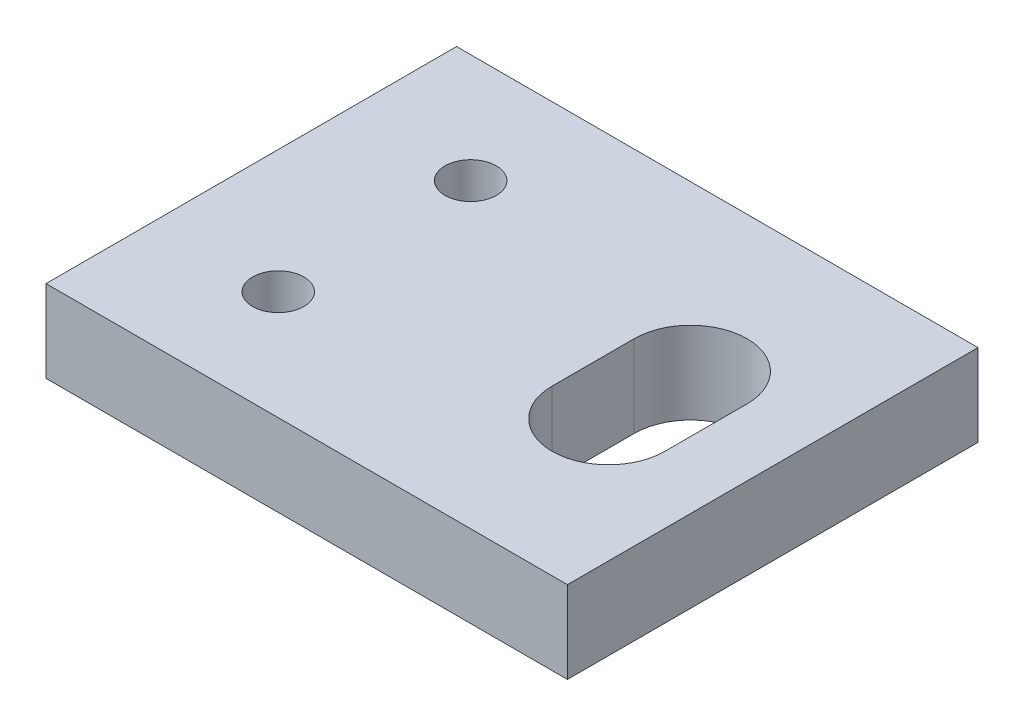
ISO-10303-21;
HEADER;
FILE_DESCRIPTION(('STEP AP214'),'2;1');
FILE_NAME('part.step','',(''),(''),'','','');
FILE_SCHEMA(('AUTOMOTIVE_DESIGN { 1 0 10303 214 1 1 1 1 }'));
ENDSEC;
DATA;
#1=APPLICATION_CONTEXT('core data for automotive mechanical design processes');
#2=APPLICATION_PROTOCOL_DEFINITION('international standard','automotive_design',2000,#1);
#3=PRODUCT_CONTEXT('',#1,'mechanical');
#4=PRODUCT('Part','Part','',(#3));
#5=PRODUCT_RELATED_PRODUCT_CATEGORY('part','',(#4));
#6=PRODUCT_DEFINITION_FORMATION('','',#4);
#7=PRODUCT_DEFINITION_CONTEXT('part definition',#1,'design');
#8=PRODUCT_DEFINITION('design','',#6,#7);
#9=PRODUCT_DEFINITION_SHAPE('','',#8);
#10=(LENGTH_UNIT() NAMED_UNIT(*) SI_UNIT(.MILLI.,.METRE.));
#11=(NAMED_UNIT(*) PLANE_ANGLE_UNIT() SI_UNIT($,.RADIAN.));
#12=(NAMED_UNIT(*) SI_UNIT($,.STERADIAN.) SOLID_ANGLE_UNIT());
#13=UNCERTAINTY_MEASURE_WITH_UNIT(LENGTH_MEASURE(1.E-05),#10,'distance_accuracy_value','');
#14=(GEOMETRIC_REPRESENTATION_CONTEXT(3) GLOBAL_UNCERTAINTY_ASSIGNED_CONTEXT((#13)) GLOBAL_UNIT_ASSIGNED_CONTEXT((#10,
#11,#12)) REPRESENTATION_CONTEXT('',''));
#15=CARTESIAN_POINT('',(0.,0.,0.));
#16=DIRECTION('',(0.,0.,1.));
#17=DIRECTION('',(1.,0.,0.));
#18=AXIS2_PLACEMENT_3D('',#15,#16,#17);
#19=CARTESIAN_POINT('',(0.,0.,0.));
#20=DIRECTION('',(-1.,0.,0.));
#21=DIRECTION('',(0.,0.,1.));
#22=AXIS2_PLACEMENT_3D('',#19,#20,#21);
#23=PLANE('',#22);
#24=DIRECTION('',(0.,0.,1.));
#25=VECTOR('',#24,1.);
#26=CARTESIAN_POINT('',(0.,4.,0.));
#27=LINE('',#26,#25);
#28=CARTESIAN_POINT('',(0.,4.,0.));
#29=VERTEX_POINT('',#28);
#30=CARTESIAN_POINT('',(0.,4.,20.));
#31=VERTEX_POINT('',#30);
#32=EDGE_CURVE('E144',#29,#31,#27,.T.);
#33=ORIENTED_EDGE('',*,*,#32,.F.);
#34=DIRECTION('',(0.,1.,0.));
#35=VECTOR('',#34,1.);
#36=CARTESIAN_POINT('',(0.,0.,0.));
#37=LINE('',#36,#35);
#38=CARTESIAN_POINT('',(0.,0.,0.));
#39=VERTEX_POINT('',#38);
#40=EDGE_CURVE('E11',#39,#29,#37,.T.);
#41=ORIENTED_EDGE('',*,*,#40,.F.);
#42=DIRECTION('',(0.,0.,1.));
#43=VECTOR('',#42,1.);
#44=CARTESIAN_POINT('',(0.,0.,0.));
#45=LINE('',#44,#43);
#46=CARTESIAN_POINT('',(0.,0.,20.));
#47=VERTEX_POINT('',#46);
#48=EDGE_CURVE('E147',#39,#47,#45,.T.);
#49=ORIENTED_EDGE('',*,*,#48,.T.);
#50=DIRECTION('',(0.,1.,0.));
#51=VECTOR('',#50,1.);
#52=CARTESIAN_POINT('',(0.,0.,20.));
#53=LINE('',#52,#51);
#54=EDGE_CURVE('E36',#47,#31,#53,.T.);
#55=ORIENTED_EDGE('',*,*,#54,.T.);
#56=EDGE_LOOP('',(#33,#41,#49,#55));
#57=FACE_BOUND('',#56,.T.);
#58=ADVANCED_FACE('F33',(#57),#23,.T.);
#59=CARTESIAN_POINT('',(25.4,0.,0.));
#60=DIRECTION('',(0.,0.,-1.));
#61=DIRECTION('',(-1.,0.,0.));
#62=AXIS2_PLACEMENT_3D('',#59,#60,#61);
#63=PLANE('',#62);
#64=DIRECTION('',(-1.,0.,0.));
#65=VECTOR('',#64,1.);
#66=CARTESIAN_POINT('',(25.4,4.,0.));
#67=LINE('',#66,#65);
#68=CARTESIAN_POINT('',(25.4,4.,0.));
#69=VERTEX_POINT('',#68);
#70=EDGE_CURVE('E151',#69,#29,#67,.T.);
#71=ORIENTED_EDGE('',*,*,#70,.F.);
#72=DIRECTION('',(0.,1.,0.));
#73=VECTOR('',#72,1.);
#74=CARTESIAN_POINT('',(25.4,0.,0.));
#75=LINE('',#74,#73);
#76=CARTESIAN_POINT('',(25.4,0.,0.));
#77=VERTEX_POINT('',#76);
#78=EDGE_CURVE('E41',#77,#69,#75,.T.);
#79=ORIENTED_EDGE('',*,*,#78,.F.);
#80=DIRECTION('',(-1.,0.,0.));
#81=VECTOR('',#80,1.);
#82=CARTESIAN_POINT('',(25.4,0.,0.));
#83=LINE('',#82,#81);
#84=EDGE_CURVE('E157',#77,#39,#83,.T.);
#85=ORIENTED_EDGE('',*,*,#84,.T.);
#86=ORIENTED_EDGE('',*,*,#40,.T.);
#87=EDGE_LOOP('',(#71,#79,#85,#86));
#88=FACE_BOUND('',#87,.T.);
#89=ADVANCED_FACE('F183',(#88),#63,.T.);
#90=CARTESIAN_POINT('',(25.4,0.,20.));
#91=DIRECTION('',(1.,0.,0.));
#92=DIRECTION('',(0.,0.,-1.));
#93=AXIS2_PLACEMENT_3D('',#90,#91,#92);
#94=PLANE('',#93);
#95=DIRECTION('',(0.,0.,-1.));
#96=VECTOR('',#95,1.);
#97=CARTESIAN_POINT('',(25.4,4.,20.));
#98=LINE('',#97,#96);
#99=CARTESIAN_POINT('',(25.4,4.,20.));
#100=VERTEX_POINT('',#99);
#101=EDGE_CURVE('E165',#100,#69,#98,.T.);
#102=ORIENTED_EDGE('',*,*,#101,.F.);
#103=DIRECTION('',(0.,1.,0.));
#104=VECTOR('',#103,1.);
#105=CARTESIAN_POINT('',(25.4,0.,20.));
#106=LINE('',#105,#104);
#107=CARTESIAN_POINT('',(25.4,0.,20.));
#108=VERTEX_POINT('',#107);
#109=EDGE_CURVE('E170',#108,#100,#106,.T.);
#110=ORIENTED_EDGE('',*,*,#109,.F.);
#111=DIRECTION('',(0.,0.,-1.));
#112=VECTOR('',#111,1.);
#113=CARTESIAN_POINT('',(25.4,0.,20.));
#114=LINE('',#113,#112);
#115=EDGE_CURVE('E154',#108,#77,#114,.T.);
#116=ORIENTED_EDGE('',*,*,#115,.T.);
#117=ORIENTED_EDGE('',*,*,#78,.T.);
#118=EDGE_LOOP('',(#102,#110,#116,#117));
#119=FACE_BOUND('',#118,.T.);
#120=ADVANCED_FACE('F188',(#119),#94,.T.);
#121=CARTESIAN_POINT('',(0.,0.,20.));
#122=DIRECTION('',(0.,0.,1.));
#123=DIRECTION('',(1.,0.,0.));
#124=AXIS2_PLACEMENT_3D('',#121,#122,#123);
#125=PLANE('',#124);
#126=DIRECTION('',(1.,0.,0.));
#127=VECTOR('',#126,1.);
#128=CARTESIAN_POINT('',(0.,4.,20.));
#129=LINE('',#128,#127);
#130=EDGE_CURVE('E162',#31,#100,#129,.T.);
#131=ORIENTED_EDGE('',*,*,#130,.F.);
#132=ORIENTED_EDGE('',*,*,#54,.F.);
#133=DIRECTION('',(1.,0.,0.));
#134=VECTOR('',#133,1.);
#135=CARTESIAN_POINT('',(0.,0.,20.));
#136=LINE('',#135,#134);
#137=EDGE_CURVE('E150',#47,#108,#136,.T.);
#138=ORIENTED_EDGE('',*,*,#137,.T.);
#139=ORIENTED_EDGE('',*,*,#109,.T.);
#140=EDGE_LOOP('',(#131,#132,#138,#139));
#141=FACE_BOUND('',#140,.T.);
#142=ADVANCED_FACE('F178',(#141),#125,.T.);
#143=CARTESIAN_POINT('',(0.,0.,0.));
#144=DIRECTION('',(0.,1.,0.));
#145=DIRECTION('',(0.,0.,1.));
#146=AXIS2_PLACEMENT_3D('',#143,#144,#145);
#147=PLANE('',#146);
#148=DIRECTION('',(0.,0.,1.));
#149=VECTOR('',#148,1.);
#150=CARTESIAN_POINT('',(16.65,0.,12.));
#151=LINE('',#150,#149);
#152=CARTESIAN_POINT('',(16.65,0.,8.));
#153=VERTEX_POINT('',#152);
#154=CARTESIAN_POINT('',(16.65,0.,12.));
#155=VERTEX_POINT('',#154);
#156=EDGE_CURVE('E106',#153,#155,#151,.T.);
#157=ORIENTED_EDGE('',*,*,#156,.T.);
#158=CARTESIAN_POINT('',(19.4,0.,12.));
#159=DIRECTION('',(0.,1.,0.));
#160=DIRECTION('',(0.,0.,1.));
#161=AXIS2_PLACEMENT_3D('',#158,#159,#160);
#162=CIRCLE('',#161,2.75);
#163=CARTESIAN_POINT('',(22.15,0.,12.));
#164=VERTEX_POINT('',#163);
#165=EDGE_CURVE('E100',#155,#164,#162,.T.);
#166=ORIENTED_EDGE('',*,*,#165,.T.);
#167=DIRECTION('',(0.,0.,-1.));
#168=VECTOR('',#167,1.);
#169=CARTESIAN_POINT('',(22.15,0.,12.));
#170=LINE('',#169,#168);
#171=CARTESIAN_POINT('',(22.15,0.,8.));
#172=VERTEX_POINT('',#171);
#173=EDGE_CURVE('E109',#164,#172,#170,.T.);
#174=ORIENTED_EDGE('',*,*,#173,.T.);
#175=CARTESIAN_POINT('',(19.4,0.,8.));
#176=DIRECTION('',(0.,1.,0.));
#177=DIRECTION('',(0.,0.,1.));
#178=AXIS2_PLACEMENT_3D('',#175,#176,#177);
#179=CIRCLE('',#178,2.75);
#180=EDGE_CURVE('E49',#172,#153,#179,.T.);
#181=ORIENTED_EDGE('',*,*,#180,.T.);
#182=EDGE_LOOP('',(#157,#166,#174,#181));
#183=FACE_BOUND('',#182,.T.);
#184=CARTESIAN_POINT('',(6.,0.,5.314));
#185=DIRECTION('',(0.,1.,0.));
#186=DIRECTION('',(0.,0.,-1.));
#187=AXIS2_PLACEMENT_3D('',#184,#185,#186);
#188=CIRCLE('',#187,1.25);
#189=CARTESIAN_POINT('',(6.,0.,4.064));
#190=VERTEX_POINT('',#189);
#191=EDGE_CURVE('E135',#190,#190,#188,.T.);
#192=ORIENTED_EDGE('',*,*,#191,.T.);
#193=EDGE_LOOP('',(#192));
#194=FACE_BOUND('',#193,.T.);
#195=CARTESIAN_POINT('',(6.,0.,14.686));
#196=DIRECTION('',(0.,1.,0.));
#197=DIRECTION('',(0.,0.,-1.));
#198=AXIS2_PLACEMENT_3D('',#195,#196,#197);
#199=CIRCLE('',#198,1.25);
#200=CARTESIAN_POINT('',(6.,0.,13.436));
#201=VERTEX_POINT('',#200);
#202=EDGE_CURVE('E141',#201,#201,#199,.T.);
#203=ORIENTED_EDGE('',*,*,#202,.T.);
#204=EDGE_LOOP('',(#203));
#205=FACE_BOUND('',#204,.T.);
#206=ORIENTED_EDGE('',*,*,#48,.F.);
#207=ORIENTED_EDGE('',*,*,#84,.F.);
#208=ORIENTED_EDGE('',*,*,#115,.F.);
#209=ORIENTED_EDGE('',*,*,#137,.F.);
#210=EDGE_LOOP('',(#206,#207,#208,#209));
#211=FACE_BOUND('',#210,.T.);
#212=ADVANCED_FACE('F113',(#183,#194,#205,#211),#147,.F.);
#213=CARTESIAN_POINT('',(0.,4.,0.));
#214=DIRECTION('',(0.,1.,0.));
#215=DIRECTION('',(0.,0.,1.));
#216=AXIS2_PLACEMENT_3D('',#213,#214,#215);
#217=PLANE('',#216);
#218=CARTESIAN_POINT('',(19.4,4.,12.));
#219=DIRECTION('',(0.,1.,0.));
#220=DIRECTION('',(0.,0.,1.));
#221=AXIS2_PLACEMENT_3D('',#218,#219,#220);
#222=CIRCLE('',#221,2.75);
#223=CARTESIAN_POINT('',(16.65,4.,12.));
#224=VERTEX_POINT('',#223);
#225=CARTESIAN_POINT('',(22.15,4.,12.));
#226=VERTEX_POINT('',#225);
#227=EDGE_CURVE('E57',#224,#226,#222,.T.);
#228=ORIENTED_EDGE('',*,*,#227,.F.);
#229=DIRECTION('',(0.,0.,1.));
#230=VECTOR('',#229,1.);
#231=CARTESIAN_POINT('',(16.65,4.,12.));
#232=LINE('',#231,#230);
#233=CARTESIAN_POINT('',(16.65,4.,8.));
#234=VERTEX_POINT('',#233);
#235=EDGE_CURVE('E116',#234,#224,#232,.T.);
#236=ORIENTED_EDGE('',*,*,#235,.F.);
#237=CARTESIAN_POINT('',(19.4,4.,8.));
#238=DIRECTION('',(0.,1.,0.));
#239=DIRECTION('',(0.,0.,1.));
#240=AXIS2_PLACEMENT_3D('',#237,#238,#239);
#241=CIRCLE('',#240,2.75);
#242=CARTESIAN_POINT('',(22.15,4.,8.));
#243=VERTEX_POINT('',#242);
#244=EDGE_CURVE('E119',#243,#234,#241,.T.);
#245=ORIENTED_EDGE('',*,*,#244,.F.);
#246=DIRECTION('',(0.,0.,-1.));
#247=VECTOR('',#246,1.);
#248=CARTESIAN_POINT('',(22.15,4.,12.));
#249=LINE('',#248,#247);
#250=EDGE_CURVE('E125',#226,#243,#249,.T.);
#251=ORIENTED_EDGE('',*,*,#250,.F.);
#252=EDGE_LOOP('',(#228,#236,#245,#251));
#253=FACE_BOUND('',#252,.T.);
#254=CARTESIAN_POINT('',(6.,4.,5.314));
#255=DIRECTION('',(0.,1.,0.));
#256=DIRECTION('',(0.,0.,-1.));
#257=AXIS2_PLACEMENT_3D('',#254,#255,#256);
#258=CIRCLE('',#257,1.25);
#259=CARTESIAN_POINT('',(6.,4.,4.064));
#260=VERTEX_POINT('',#259);
#261=EDGE_CURVE('E131',#260,#260,#258,.T.);
#262=ORIENTED_EDGE('',*,*,#261,.F.);
#263=EDGE_LOOP('',(#262));
#264=FACE_BOUND('',#263,.T.);
#265=CARTESIAN_POINT('',(6.,4.,14.686));
#266=DIRECTION('',(0.,1.,0.));
#267=DIRECTION('',(0.,0.,-1.));
#268=AXIS2_PLACEMENT_3D('',#265,#266,#267);
#269=CIRCLE('',#268,1.25);
#270=CARTESIAN_POINT('',(6.,4.,13.436));
#271=VERTEX_POINT('',#270);
#272=EDGE_CURVE('E138',#271,#271,#269,.T.);
#273=ORIENTED_EDGE('',*,*,#272,.F.);
#274=EDGE_LOOP('',(#273));
#275=FACE_BOUND('',#274,.T.);
#276=ORIENTED_EDGE('',*,*,#32,.T.);
#277=ORIENTED_EDGE('',*,*,#130,.T.);
#278=ORIENTED_EDGE('',*,*,#101,.T.);
#279=ORIENTED_EDGE('',*,*,#70,.T.);
#280=EDGE_LOOP('',(#276,#277,#278,#279));
#281=FACE_BOUND('',#280,.T.);
#282=ADVANCED_FACE('F180',(#253,#264,#275,#281),#217,.T.);
#283=CARTESIAN_POINT('',(6.,0.,14.686));
#284=DIRECTION('',(0.,1.,0.));
#285=DIRECTION('',(0.,0.,1.));
#286=AXIS2_PLACEMENT_3D('',#283,#284,#285);
#287=CYLINDRICAL_SURFACE('',#286,1.25);
#288=ORIENTED_EDGE('',*,*,#202,.F.);
#289=EDGE_LOOP('',(#288));
#290=FACE_BOUND('',#289,.T.);
#291=ORIENTED_EDGE('',*,*,#272,.T.);
#292=EDGE_LOOP('',(#291));
#293=FACE_BOUND('',#292,.T.);
#294=ADVANCED_FACE('F230',(#290,#293),#287,.F.);
#295=CARTESIAN_POINT('',(6.,0.,5.314));
#296=DIRECTION('',(0.,1.,0.));
#297=DIRECTION('',(0.,0.,1.));
#298=AXIS2_PLACEMENT_3D('',#295,#296,#297);
#299=CYLINDRICAL_SURFACE('',#298,1.25);
#300=ORIENTED_EDGE('',*,*,#191,.F.);
#301=EDGE_LOOP('',(#300));
#302=FACE_BOUND('',#301,.T.);
#303=ORIENTED_EDGE('',*,*,#261,.T.);
#304=EDGE_LOOP('',(#303));
#305=FACE_BOUND('',#304,.T.);
#306=ADVANCED_FACE('F240',(#302,#305),#299,.F.);
#307=CARTESIAN_POINT('',(19.4,0.,12.));
#308=DIRECTION('',(0.,1.,0.));
#309=DIRECTION('',(0.,0.,1.));
#310=AXIS2_PLACEMENT_3D('',#307,#308,#309);
#311=CYLINDRICAL_SURFACE('',#310,2.75);
#312=ORIENTED_EDGE('',*,*,#227,.T.);
#313=DIRECTION('',(0.,1.,0.));
#314=VECTOR('',#313,1.);
#315=CARTESIAN_POINT('',(22.15,0.,12.));
#316=LINE('',#315,#314);
#317=EDGE_CURVE('E96',#164,#226,#316,.T.);
#318=ORIENTED_EDGE('',*,*,#317,.F.);
#319=ORIENTED_EDGE('',*,*,#165,.F.);
#320=DIRECTION('',(0.,1.,0.));
#321=VECTOR('',#320,1.);
#322=CARTESIAN_POINT('',(16.65,0.,12.));
#323=LINE('',#322,#321);
#324=EDGE_CURVE('E129',#155,#224,#323,.T.);
#325=ORIENTED_EDGE('',*,*,#324,.T.);
#326=EDGE_LOOP('',(#312,#318,#319,#325));
#327=FACE_BOUND('',#326,.T.);
#328=ADVANCED_FACE('F98',(#327),#311,.F.);
#329=CARTESIAN_POINT('',(16.65,0.,12.));
#330=DIRECTION('',(-1.,0.,0.));
#331=DIRECTION('',(0.,0.,1.));
#332=AXIS2_PLACEMENT_3D('',#329,#330,#331);
#333=PLANE('',#332);
#334=ORIENTED_EDGE('',*,*,#235,.T.);
#335=ORIENTED_EDGE('',*,*,#324,.F.);
#336=ORIENTED_EDGE('',*,*,#156,.F.);
#337=DIRECTION('',(0.,1.,0.));
#338=VECTOR('',#337,1.);
#339=CARTESIAN_POINT('',(16.65,0.,8.));
#340=LINE('',#339,#338);
#341=EDGE_CURVE('E132',#153,#234,#340,.T.);
#342=ORIENTED_EDGE('',*,*,#341,.T.);
#343=EDGE_LOOP('',(#334,#335,#336,#342));
#344=FACE_BOUND('',#343,.T.);
#345=ADVANCED_FACE('F259',(#344),#333,.F.);
#346=CARTESIAN_POINT('',(19.4,0.,8.));
#347=DIRECTION('',(0.,1.,0.));
#348=DIRECTION('',(0.,0.,1.));
#349=AXIS2_PLACEMENT_3D('',#346,#347,#348);
#350=CYLINDRICAL_SURFACE('',#349,2.75);
#351=ORIENTED_EDGE('',*,*,#244,.T.);
#352=ORIENTED_EDGE('',*,*,#341,.F.);
#353=ORIENTED_EDGE('',*,*,#180,.F.);
#354=DIRECTION('',(0.,1.,0.));
#355=VECTOR('',#354,1.);
#356=CARTESIAN_POINT('',(22.15,0.,8.));
#357=LINE('',#356,#355);
#358=EDGE_CURVE('E105',#172,#243,#357,.T.);
#359=ORIENTED_EDGE('',*,*,#358,.T.);
#360=EDGE_LOOP('',(#351,#352,#353,#359));
#361=FACE_BOUND('',#360,.T.);
#362=ADVANCED_FACE('F268',(#361),#350,.F.);
#363=CARTESIAN_POINT('',(22.15,0.,12.));
#364=DIRECTION('',(1.,0.,0.));
#365=DIRECTION('',(0.,0.,-1.));
#366=AXIS2_PLACEMENT_3D('',#363,#364,#365);
#367=PLANE('',#366);
#368=ORIENTED_EDGE('',*,*,#250,.T.);
#369=ORIENTED_EDGE('',*,*,#358,.F.);
#370=ORIENTED_EDGE('',*,*,#173,.F.);
#371=ORIENTED_EDGE('',*,*,#317,.T.);
#372=EDGE_LOOP('',(#368,#369,#370,#371));
#373=FACE_BOUND('',#372,.T.);
#374=ADVANCED_FACE('F110',(#373),#367,.F.);
#375=CLOSED_SHELL('',(#58,#89,#120,#142,#212,#282,#294,#306,#328,#345,#362,#374));
#376=MANIFOLD_SOLID_BREP('B2',#375);
#377=ADVANCED_BREP_SHAPE_REPRESENTATION('',(#18,#376),#14);
#378=SHAPE_DEFINITION_REPRESENTATION(#9,#377);
ENDSEC;
END-ISO-10303-21;
